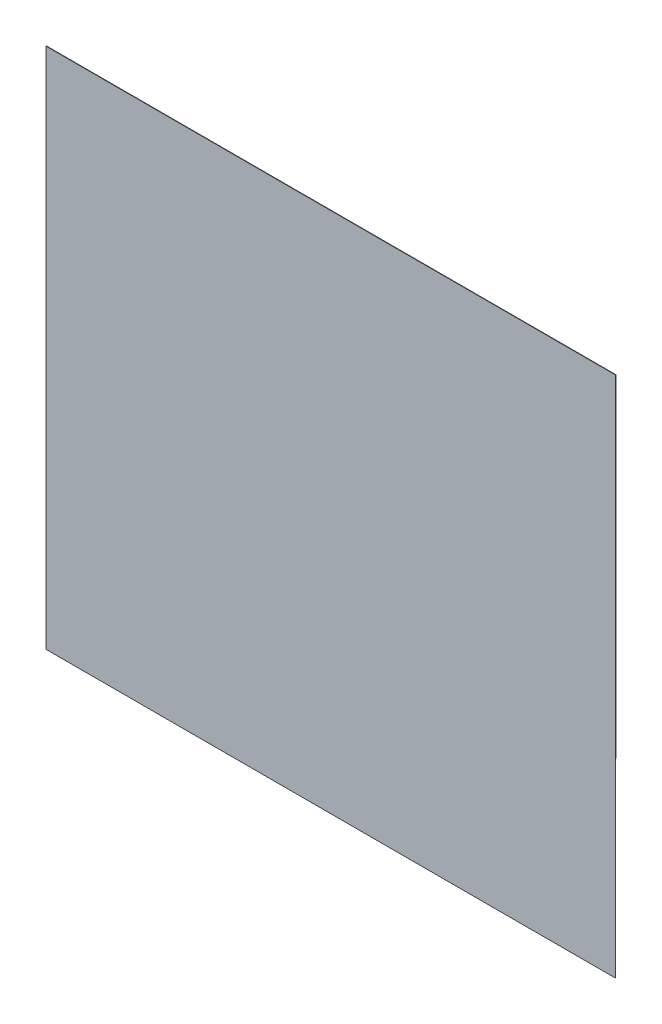
ISO-10303-21;
HEADER;
FILE_DESCRIPTION(('STEP AP214'),'2;1');
FILE_NAME('part.step','',(''),(''),'','','');
FILE_SCHEMA(('AUTOMOTIVE_DESIGN { 1 0 10303 214 1 1 1 1 }'));
ENDSEC;
DATA;
#1=APPLICATION_CONTEXT('core data for automotive mechanical design processes');
#2=APPLICATION_PROTOCOL_DEFINITION('international standard','automotive_design',2000,#1);
#3=PRODUCT_CONTEXT('',#1,'mechanical');
#4=PRODUCT('Part','Part','',(#3));
#5=PRODUCT_RELATED_PRODUCT_CATEGORY('part','',(#4));
#6=PRODUCT_DEFINITION_FORMATION('','',#4);
#7=PRODUCT_DEFINITION_CONTEXT('part definition',#1,'design');
#8=PRODUCT_DEFINITION('design','',#6,#7);
#9=PRODUCT_DEFINITION_SHAPE('','',#8);
#10=(LENGTH_UNIT() NAMED_UNIT(*) SI_UNIT(.MILLI.,.METRE.));
#11=(NAMED_UNIT(*) PLANE_ANGLE_UNIT() SI_UNIT($,.RADIAN.));
#12=(NAMED_UNIT(*) SI_UNIT($,.STERADIAN.) SOLID_ANGLE_UNIT());
#13=UNCERTAINTY_MEASURE_WITH_UNIT(LENGTH_MEASURE(1.E-05),#10,'distance_accuracy_value','');
#14=(GEOMETRIC_REPRESENTATION_CONTEXT(3) GLOBAL_UNCERTAINTY_ASSIGNED_CONTEXT((#13)) GLOBAL_UNIT_ASSIGNED_CONTEXT((#10,
#11,#12)) REPRESENTATION_CONTEXT('',''));
#15=CARTESIAN_POINT('',(0.,0.,0.));
#16=DIRECTION('',(0.,0.,1.));
#17=DIRECTION('',(1.,0.,0.));
#18=AXIS2_PLACEMENT_3D('',#15,#16,#17);
#19=CARTESIAN_POINT('',(-4.889101065271E-05,2.340026477841E-05,0.00100076));
#20=DIRECTION('',(0.,0.,1.));
#21=DIRECTION('',(1.,0.,0.));
#22=AXIS2_PLACEMENT_3D('',#19,#20,#21);
#23=PLANE('',#22);
#24=DIRECTION('',(1.,0.,0.));
#25=VECTOR('',#24,1.);
#26=CARTESIAN_POINT('',(-0.65296542,-0.59927744,0.00100076));
#27=LINE('',#26,#25);
#28=CARTESIAN_POINT('',(-0.65296542,-0.59927744,0.00100076));
#29=VERTEX_POINT('',#28);
#30=CARTESIAN_POINT('',(0.65276984,-0.59927744,0.00100076));
#31=VERTEX_POINT('',#30);
#32=EDGE_CURVE('E71',#29,#31,#27,.T.);
#33=ORIENTED_EDGE('',*,*,#32,.T.);
#34=DIRECTION('',(0.000163179843206128,0.999999986686169,0.));
#35=VECTOR('',#34,1.);
#36=CARTESIAN_POINT('',(0.65276984,-0.59927744,0.00100076));
#37=LINE('',#36,#35);
#38=CARTESIAN_POINT('',(0.65296542,0.59927744,0.00100076));
#39=VERTEX_POINT('',#38);
#40=EDGE_CURVE('E68',#31,#39,#37,.T.);
#41=ORIENTED_EDGE('',*,*,#40,.T.);
#42=DIRECTION('',(-1.,0.,0.));
#43=VECTOR('',#42,1.);
#44=CARTESIAN_POINT('',(0.65296542,0.59927744,0.00100076));
#45=LINE('',#44,#43);
#46=CARTESIAN_POINT('',(-0.65296542,0.59927744,0.00100076));
#47=VERTEX_POINT('',#46);
#48=EDGE_CURVE('E55',#39,#47,#45,.T.);
#49=ORIENTED_EDGE('',*,*,#48,.T.);
#50=DIRECTION('',(0.,-1.,0.));
#51=VECTOR('',#50,1.);
#52=CARTESIAN_POINT('',(-0.65296542,0.59927744,0.00100076));
#53=LINE('',#52,#51);
#54=EDGE_CURVE('E11',#47,#29,#53,.T.);
#55=ORIENTED_EDGE('',*,*,#54,.T.);
#56=EDGE_LOOP('',(#33,#41,#49,#55));
#57=FACE_BOUND('',#56,.T.);
#58=ADVANCED_FACE('F17',(#57),#23,.T.);
#59=CARTESIAN_POINT('',(-4.889101065271E-05,2.340026477841E-05,0.));
#60=DIRECTION('',(0.,0.,1.));
#61=DIRECTION('',(1.,0.,0.));
#62=AXIS2_PLACEMENT_3D('',#59,#60,#61);
#63=PLANE('',#62);
#64=DIRECTION('',(0.,-1.,0.));
#65=VECTOR('',#64,1.);
#66=CARTESIAN_POINT('',(-0.65296542,0.59927744,0.));
#67=LINE('',#66,#65);
#68=CARTESIAN_POINT('',(-0.65296542,0.59927744,0.));
#69=VERTEX_POINT('',#68);
#70=CARTESIAN_POINT('',(-0.65296542,-0.59927744,0.));
#71=VERTEX_POINT('',#70);
#72=EDGE_CURVE('E21',#69,#71,#67,.T.);
#73=ORIENTED_EDGE('',*,*,#72,.F.);
#74=DIRECTION('',(-1.,0.,0.));
#75=VECTOR('',#74,1.);
#76=CARTESIAN_POINT('',(0.65296542,0.59927744,0.));
#77=LINE('',#76,#75);
#78=CARTESIAN_POINT('',(0.65296542,0.59927744,0.));
#79=VERTEX_POINT('',#78);
#80=EDGE_CURVE('E76',#79,#69,#77,.T.);
#81=ORIENTED_EDGE('',*,*,#80,.F.);
#82=DIRECTION('',(0.000163179843206128,0.999999986686169,0.));
#83=VECTOR('',#82,1.);
#84=CARTESIAN_POINT('',(0.65276984,-0.59927744,0.));
#85=LINE('',#84,#83);
#86=CARTESIAN_POINT('',(0.65276984,-0.59927744,0.));
#87=VERTEX_POINT('',#86);
#88=EDGE_CURVE('E80',#87,#79,#85,.T.);
#89=ORIENTED_EDGE('',*,*,#88,.F.);
#90=DIRECTION('',(1.,0.,0.));
#91=VECTOR('',#90,1.);
#92=CARTESIAN_POINT('',(-0.65296542,-0.59927744,0.));
#93=LINE('',#92,#91);
#94=EDGE_CURVE('E163',#71,#87,#93,.T.);
#95=ORIENTED_EDGE('',*,*,#94,.F.);
#96=EDGE_LOOP('',(#73,#81,#89,#95));
#97=FACE_BOUND('',#96,.T.);
#98=ADVANCED_FACE('F19',(#97),#63,.F.);
#99=CARTESIAN_POINT('',(-0.65296542,0.59927744,0.));
#100=DIRECTION('',(1.,0.,0.));
#101=DIRECTION('',(0.,1.,0.));
#102=AXIS2_PLACEMENT_3D('',#99,#100,#101);
#103=PLANE('',#102);
#104=ORIENTED_EDGE('',*,*,#72,.T.);
#105=DIRECTION('',(0.,0.,1.));
#106=VECTOR('',#105,1.);
#107=CARTESIAN_POINT('',(-0.65296542,-0.59927744,0.));
#108=LINE('',#107,#106);
#109=EDGE_CURVE('E85',#71,#29,#108,.T.);
#110=ORIENTED_EDGE('',*,*,#109,.T.);
#111=ORIENTED_EDGE('',*,*,#54,.F.);
#112=DIRECTION('',(0.,0.,1.));
#113=VECTOR('',#112,1.);
#114=CARTESIAN_POINT('',(-0.65296542,0.59927744,0.));
#115=LINE('',#114,#113);
#116=EDGE_CURVE('E62',#69,#47,#115,.T.);
#117=ORIENTED_EDGE('',*,*,#116,.F.);
#118=EDGE_LOOP('',(#104,#110,#111,#117));
#119=FACE_BOUND('',#118,.T.);
#120=ADVANCED_FACE('F120',(#119),#103,.F.);
#121=CARTESIAN_POINT('',(0.65296542,0.59927744,0.));
#122=DIRECTION('',(0.,-1.,0.));
#123=DIRECTION('',(0.,0.,-1.));
#124=AXIS2_PLACEMENT_3D('',#121,#122,#123);
#125=PLANE('',#124);
#126=ORIENTED_EDGE('',*,*,#80,.T.);
#127=ORIENTED_EDGE('',*,*,#116,.T.);
#128=ORIENTED_EDGE('',*,*,#48,.F.);
#129=DIRECTION('',(0.,0.,1.));
#130=VECTOR('',#129,1.);
#131=CARTESIAN_POINT('',(0.65296542,0.59927744,0.));
#132=LINE('',#131,#130);
#133=EDGE_CURVE('E60',#79,#39,#132,.T.);
#134=ORIENTED_EDGE('',*,*,#133,.F.);
#135=EDGE_LOOP('',(#126,#127,#128,#134));
#136=FACE_BOUND('',#135,.T.);
#137=ADVANCED_FACE('F58',(#136),#125,.F.);
#138=CARTESIAN_POINT('',(0.65276984,-0.59927744,0.));
#139=DIRECTION('',(-0.999999986686169,0.000163179843206128,0.));
#140=DIRECTION('',(0.,0.,1.));
#141=AXIS2_PLACEMENT_3D('',#138,#139,#140);
#142=PLANE('',#141);
#143=ORIENTED_EDGE('',*,*,#88,.T.);
#144=ORIENTED_EDGE('',*,*,#133,.T.);
#145=ORIENTED_EDGE('',*,*,#40,.F.);
#146=DIRECTION('',(0.,0.,1.));
#147=VECTOR('',#146,1.);
#148=CARTESIAN_POINT('',(0.65276984,-0.59927744,0.));
#149=LINE('',#148,#147);
#150=EDGE_CURVE('E158',#87,#31,#149,.T.);
#151=ORIENTED_EDGE('',*,*,#150,.F.);
#152=EDGE_LOOP('',(#143,#144,#145,#151));
#153=FACE_BOUND('',#152,.T.);
#154=ADVANCED_FACE('F78',(#153),#142,.F.);
#155=CARTESIAN_POINT('',(-0.65296542,-0.59927744,0.));
#156=DIRECTION('',(0.,1.,0.));
#157=DIRECTION('',(1.,0.,0.));
#158=AXIS2_PLACEMENT_3D('',#155,#156,#157);
#159=PLANE('',#158);
#160=ORIENTED_EDGE('',*,*,#94,.T.);
#161=ORIENTED_EDGE('',*,*,#150,.T.);
#162=ORIENTED_EDGE('',*,*,#32,.F.);
#163=ORIENTED_EDGE('',*,*,#109,.F.);
#164=EDGE_LOOP('',(#160,#161,#162,#163));
#165=FACE_BOUND('',#164,.T.);
#166=ADVANCED_FACE('F99',(#165),#159,.F.);
#167=CLOSED_SHELL('',(#58,#98,#120,#137,#154,#166));
#168=MANIFOLD_SOLID_BREP('B1',#167);
#169=ADVANCED_BREP_SHAPE_REPRESENTATION('',(#18,#168),#14);
#170=SHAPE_DEFINITION_REPRESENTATION(#9,#169);
ENDSEC;
END-ISO-10303-21;
